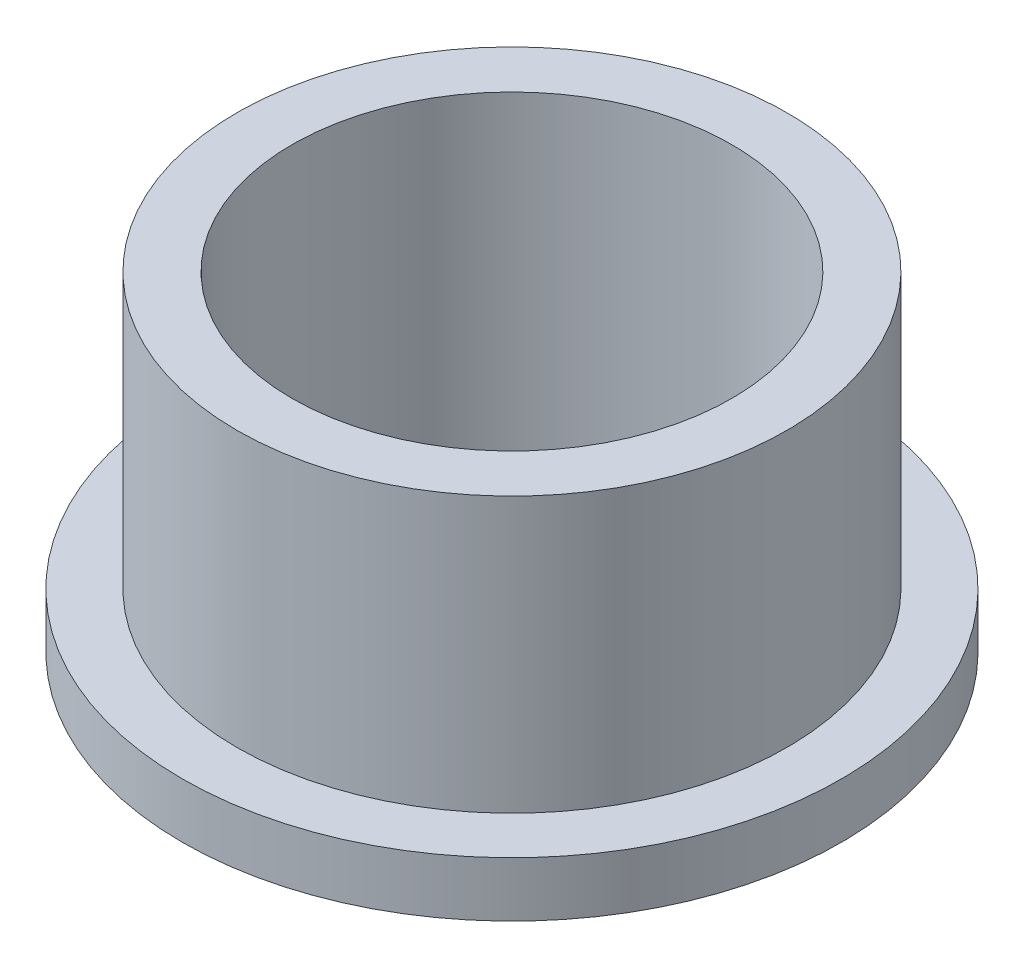
ISO-10303-21;
HEADER;
FILE_DESCRIPTION(('STEP AP214'),'2;1');
FILE_NAME('part.step','',(''),(''),'','','');
FILE_SCHEMA(('AUTOMOTIVE_DESIGN { 1 0 10303 214 1 1 1 1 }'));
ENDSEC;
DATA;
#1=APPLICATION_CONTEXT('core data for automotive mechanical design processes');
#2=APPLICATION_PROTOCOL_DEFINITION('international standard','automotive_design',2000,#1);
#3=PRODUCT_CONTEXT('',#1,'mechanical');
#4=PRODUCT('Part','Part','',(#3));
#5=PRODUCT_RELATED_PRODUCT_CATEGORY('part','',(#4));
#6=PRODUCT_DEFINITION_FORMATION('','',#4);
#7=PRODUCT_DEFINITION_CONTEXT('part definition',#1,'design');
#8=PRODUCT_DEFINITION('design','',#6,#7);
#9=PRODUCT_DEFINITION_SHAPE('','',#8);
#10=(LENGTH_UNIT() NAMED_UNIT(*) SI_UNIT(.MILLI.,.METRE.));
#11=(NAMED_UNIT(*) PLANE_ANGLE_UNIT() SI_UNIT($,.RADIAN.));
#12=(NAMED_UNIT(*) SI_UNIT($,.STERADIAN.) SOLID_ANGLE_UNIT());
#13=UNCERTAINTY_MEASURE_WITH_UNIT(LENGTH_MEASURE(1.E-05),#10,'distance_accuracy_value','');
#14=(GEOMETRIC_REPRESENTATION_CONTEXT(3) GLOBAL_UNCERTAINTY_ASSIGNED_CONTEXT((#13)) GLOBAL_UNIT_ASSIGNED_CONTEXT((#10,
#11,#12)) REPRESENTATION_CONTEXT('',''));
#15=CARTESIAN_POINT('',(0.,0.,0.));
#16=DIRECTION('',(0.,0.,1.));
#17=DIRECTION('',(1.,0.,0.));
#18=AXIS2_PLACEMENT_3D('',#15,#16,#17);
#19=CARTESIAN_POINT('',(0.,19.05,0.));
#20=DIRECTION('',(0.,1.,0.));
#21=DIRECTION('',(0.,0.,1.));
#22=AXIS2_PLACEMENT_3D('',#19,#20,#21);
#23=PLANE('',#22);
#24=CARTESIAN_POINT('',(0.,19.05,0.));
#25=DIRECTION('',(0.,1.,0.));
#26=DIRECTION('',(0.,0.,1.));
#27=AXIS2_PLACEMENT_3D('',#24,#25,#26);
#28=CIRCLE('',#27,15.9004);
#29=CARTESIAN_POINT('',(0.,19.05,15.9004));
#30=VERTEX_POINT('',#29);
#31=EDGE_CURVE('E10',#30,#30,#28,.T.);
#32=ORIENTED_EDGE('',*,*,#31,.T.);
#33=EDGE_LOOP('',(#32));
#34=FACE_BOUND('',#33,.T.);
#35=CARTESIAN_POINT('',(0.,19.05,0.));
#36=DIRECTION('',(0.,1.,0.));
#37=DIRECTION('',(0.,0.,1.));
#38=AXIS2_PLACEMENT_3D('',#35,#36,#37);
#39=CIRCLE('',#38,12.71016);
#40=CARTESIAN_POINT('',(0.,19.05,12.71016));
#41=VERTEX_POINT('',#40);
#42=EDGE_CURVE('E41',#41,#41,#39,.T.);
#43=ORIENTED_EDGE('',*,*,#42,.F.);
#44=EDGE_LOOP('',(#43));
#45=FACE_BOUND('',#44,.T.);
#46=ADVANCED_FACE('F34',(#34,#45),#23,.T.);
#47=CARTESIAN_POINT('',(0.,0.,0.));
#48=DIRECTION('',(0.,1.,0.));
#49=DIRECTION('',(0.,0.,1.));
#50=AXIS2_PLACEMENT_3D('',#47,#48,#49);
#51=PLANE('',#50);
#52=CARTESIAN_POINT('',(0.,0.,0.));
#53=DIRECTION('',(0.,1.,0.));
#54=DIRECTION('',(0.,0.,1.));
#55=AXIS2_PLACEMENT_3D('',#52,#53,#54);
#56=CIRCLE('',#55,12.71016);
#57=CARTESIAN_POINT('',(0.,0.,12.71016));
#58=VERTEX_POINT('',#57);
#59=EDGE_CURVE('E45',#58,#58,#56,.T.);
#60=ORIENTED_EDGE('',*,*,#59,.T.);
#61=EDGE_LOOP('',(#60));
#62=FACE_BOUND('',#61,.T.);
#63=CARTESIAN_POINT('',(0.,0.,0.));
#64=DIRECTION('',(0.,1.,0.));
#65=DIRECTION('',(0.,0.,1.));
#66=AXIS2_PLACEMENT_3D('',#63,#64,#65);
#67=CIRCLE('',#66,19.05);
#68=CARTESIAN_POINT('',(0.,0.,19.05));
#69=VERTEX_POINT('',#68);
#70=EDGE_CURVE('E52',#69,#69,#67,.T.);
#71=ORIENTED_EDGE('',*,*,#70,.F.);
#72=EDGE_LOOP('',(#71));
#73=FACE_BOUND('',#72,.T.);
#74=ADVANCED_FACE('F77',(#62,#73),#51,.F.);
#75=CARTESIAN_POINT('',(0.,19.05,0.));
#76=DIRECTION('',(0.,-1.,0.));
#77=DIRECTION('',(0.,0.,-1.));
#78=AXIS2_PLACEMENT_3D('',#75,#76,#77);
#79=CYLINDRICAL_SURFACE('',#78,15.9004);
#80=CARTESIAN_POINT('',(0.,3.175,0.));
#81=DIRECTION('',(0.,1.,0.));
#82=DIRECTION('',(0.,0.,1.));
#83=AXIS2_PLACEMENT_3D('',#80,#81,#82);
#84=CIRCLE('',#83,15.9004);
#85=CARTESIAN_POINT('',(0.,3.175,15.9004));
#86=VERTEX_POINT('',#85);
#87=EDGE_CURVE('E55',#86,#86,#84,.T.);
#88=ORIENTED_EDGE('',*,*,#87,.T.);
#89=EDGE_LOOP('',(#88));
#90=FACE_BOUND('',#89,.T.);
#91=ORIENTED_EDGE('',*,*,#31,.F.);
#92=EDGE_LOOP('',(#91));
#93=FACE_BOUND('',#92,.T.);
#94=ADVANCED_FACE('F36',(#90,#93),#79,.T.);
#95=CARTESIAN_POINT('',(0.,19.05,0.));
#96=DIRECTION('',(0.,-1.,0.));
#97=DIRECTION('',(0.,0.,-1.));
#98=AXIS2_PLACEMENT_3D('',#95,#96,#97);
#99=CYLINDRICAL_SURFACE('',#98,12.71016);
#100=ORIENTED_EDGE('',*,*,#42,.T.);
#101=EDGE_LOOP('',(#100));
#102=FACE_BOUND('',#101,.T.);
#103=ORIENTED_EDGE('',*,*,#59,.F.);
#104=EDGE_LOOP('',(#103));
#105=FACE_BOUND('',#104,.T.);
#106=ADVANCED_FACE('F66',(#102,#105),#99,.F.);
#107=CARTESIAN_POINT('',(0.,3.175,0.));
#108=DIRECTION('',(0.,1.,0.));
#109=DIRECTION('',(0.,0.,1.));
#110=AXIS2_PLACEMENT_3D('',#107,#108,#109);
#111=PLANE('',#110);
#112=CARTESIAN_POINT('',(0.,3.175,0.));
#113=DIRECTION('',(0.,1.,0.));
#114=DIRECTION('',(0.,0.,1.));
#115=AXIS2_PLACEMENT_3D('',#112,#113,#114);
#116=CIRCLE('',#115,19.05);
#117=CARTESIAN_POINT('',(0.,3.175,19.05));
#118=VERTEX_POINT('',#117);
#119=EDGE_CURVE('E50',#118,#118,#116,.T.);
#120=ORIENTED_EDGE('',*,*,#119,.T.);
#121=EDGE_LOOP('',(#120));
#122=FACE_BOUND('',#121,.T.);
#123=ORIENTED_EDGE('',*,*,#87,.F.);
#124=EDGE_LOOP('',(#123));
#125=FACE_BOUND('',#124,.T.);
#126=ADVANCED_FACE('F63',(#122,#125),#111,.T.);
#127=CARTESIAN_POINT('',(0.,3.175,0.));
#128=DIRECTION('',(0.,-1.,0.));
#129=DIRECTION('',(0.,0.,-1.));
#130=AXIS2_PLACEMENT_3D('',#127,#128,#129);
#131=CYLINDRICAL_SURFACE('',#130,19.05);
#132=ORIENTED_EDGE('',*,*,#119,.F.);
#133=EDGE_LOOP('',(#132));
#134=FACE_BOUND('',#133,.T.);
#135=ORIENTED_EDGE('',*,*,#70,.T.);
#136=EDGE_LOOP('',(#135));
#137=FACE_BOUND('',#136,.T.);
#138=ADVANCED_FACE('F65',(#134,#137),#131,.T.);
#139=CLOSED_SHELL('',(#46,#74,#94,#106,#126,#138));
#140=MANIFOLD_SOLID_BREP('B2',#139);
#141=ADVANCED_BREP_SHAPE_REPRESENTATION('',(#18,#140),#14);
#142=SHAPE_DEFINITION_REPRESENTATION(#9,#141);
ENDSEC;
END-ISO-10303-21;
